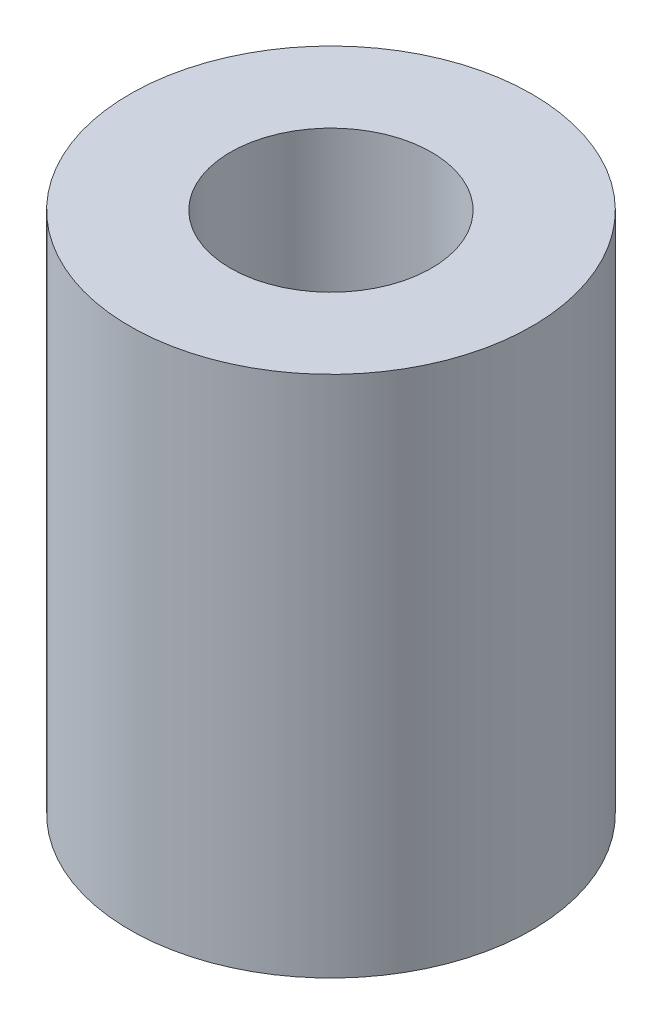
ISO-10303-21;
HEADER;
FILE_DESCRIPTION(('STEP AP214'),'2;1');
FILE_NAME('part.step','',(''),(''),'','','');
FILE_SCHEMA(('AUTOMOTIVE_DESIGN { 1 0 10303 214 1 1 1 1 }'));
ENDSEC;
DATA;
#1=APPLICATION_CONTEXT('core data for automotive mechanical design processes');
#2=APPLICATION_PROTOCOL_DEFINITION('international standard','automotive_design',2000,#1);
#3=PRODUCT_CONTEXT('',#1,'mechanical');
#4=PRODUCT('Part','Part','',(#3));
#5=PRODUCT_RELATED_PRODUCT_CATEGORY('part','',(#4));
#6=PRODUCT_DEFINITION_FORMATION('','',#4);
#7=PRODUCT_DEFINITION_CONTEXT('part definition',#1,'design');
#8=PRODUCT_DEFINITION('design','',#6,#7);
#9=PRODUCT_DEFINITION_SHAPE('','',#8);
#10=(LENGTH_UNIT() NAMED_UNIT(*) SI_UNIT(.MILLI.,.METRE.));
#11=(NAMED_UNIT(*) PLANE_ANGLE_UNIT() SI_UNIT($,.RADIAN.));
#12=(NAMED_UNIT(*) SI_UNIT($,.STERADIAN.) SOLID_ANGLE_UNIT());
#13=UNCERTAINTY_MEASURE_WITH_UNIT(LENGTH_MEASURE(1.E-05),#10,'distance_accuracy_value','');
#14=(GEOMETRIC_REPRESENTATION_CONTEXT(3) GLOBAL_UNCERTAINTY_ASSIGNED_CONTEXT((#13)) GLOBAL_UNIT_ASSIGNED_CONTEXT((#10,
#11,#12)) REPRESENTATION_CONTEXT('',''));
#15=CARTESIAN_POINT('',(0.,0.,0.));
#16=DIRECTION('',(0.,0.,1.));
#17=DIRECTION('',(1.,0.,0.));
#18=AXIS2_PLACEMENT_3D('',#15,#16,#17);
#19=CARTESIAN_POINT('',(83.5660679032848,28.7074983767564,197.378926801223));
#20=DIRECTION('',(0.,1.,0.));
#21=DIRECTION('',(0.,0.,1.));
#22=AXIS2_PLACEMENT_3D('',#19,#20,#21);
#23=CYLINDRICAL_SURFACE('',#22,1.5875);
#24=CARTESIAN_POINT('',(83.5660679032848,36.9624983767565,197.378926801223));
#25=DIRECTION('',(0.,1.,0.));
#26=DIRECTION('',(0.,0.,1.));
#27=AXIS2_PLACEMENT_3D('',#24,#25,#26);
#28=CIRCLE('',#27,1.5875);
#29=CARTESIAN_POINT('',(83.5660679032848,36.9624983767565,198.966426801223));
#30=VERTEX_POINT('',#29);
#31=EDGE_CURVE('E18',#30,#30,#28,.F.);
#32=ORIENTED_EDGE('',*,*,#31,.F.);
#33=EDGE_LOOP('',(#32));
#34=FACE_BOUND('',#33,.T.);
#35=CARTESIAN_POINT('',(83.5660679032848,28.7074983767564,197.378926801223));
#36=DIRECTION('',(0.,1.,0.));
#37=DIRECTION('',(0.,0.,1.));
#38=AXIS2_PLACEMENT_3D('',#35,#36,#37);
#39=CIRCLE('',#38,1.5875);
#40=CARTESIAN_POINT('',(83.5660679032848,28.7074983767564,198.966426801223));
#41=VERTEX_POINT('',#40);
#42=EDGE_CURVE('E30',#41,#41,#39,.F.);
#43=ORIENTED_EDGE('',*,*,#42,.T.);
#44=EDGE_LOOP('',(#43));
#45=FACE_BOUND('',#44,.T.);
#46=ADVANCED_FACE('F15',(#34,#45),#23,.F.);
#47=CARTESIAN_POINT('',(83.5660679032848,36.9624983767565,197.378926801223));
#48=DIRECTION('',(0.,1.,0.));
#49=DIRECTION('',(0.,0.,1.));
#50=AXIS2_PLACEMENT_3D('',#47,#48,#49);
#51=PLANE('',#50);
#52=ORIENTED_EDGE('',*,*,#31,.T.);
#53=EDGE_LOOP('',(#52));
#54=FACE_BOUND('',#53,.T.);
#55=CARTESIAN_POINT('',(83.5660679032848,36.9624983767565,197.378926801223));
#56=DIRECTION('',(0.,-1.,0.));
#57=DIRECTION('',(0.,0.,-1.));
#58=AXIS2_PLACEMENT_3D('',#55,#56,#57);
#59=CIRCLE('',#58,3.175);
#60=CARTESIAN_POINT('',(83.5660679032848,36.9624983767565,194.203926801223));
#61=VERTEX_POINT('',#60);
#62=EDGE_CURVE('E23',#61,#61,#59,.T.);
#63=ORIENTED_EDGE('',*,*,#62,.F.);
#64=EDGE_LOOP('',(#63));
#65=FACE_BOUND('',#64,.T.);
#66=ADVANCED_FACE('F40',(#54,#65),#51,.T.);
#67=CARTESIAN_POINT('',(83.5660679032848,28.7074983767564,197.378926801223));
#68=DIRECTION('',(0.,1.,0.));
#69=DIRECTION('',(0.,0.,1.));
#70=AXIS2_PLACEMENT_3D('',#67,#68,#69);
#71=PLANE('',#70);
#72=ORIENTED_EDGE('',*,*,#42,.F.);
#73=EDGE_LOOP('',(#72));
#74=FACE_BOUND('',#73,.T.);
#75=CARTESIAN_POINT('',(83.5660679032848,28.7074983767564,197.378926801223));
#76=DIRECTION('',(0.,-1.,0.));
#77=DIRECTION('',(0.,0.,-1.));
#78=AXIS2_PLACEMENT_3D('',#75,#76,#77);
#79=CIRCLE('',#78,3.175);
#80=CARTESIAN_POINT('',(83.5660679032848,28.7074983767564,194.203926801223));
#81=VERTEX_POINT('',#80);
#82=EDGE_CURVE('E10',#81,#81,#79,.F.);
#83=ORIENTED_EDGE('',*,*,#82,.F.);
#84=EDGE_LOOP('',(#83));
#85=FACE_BOUND('',#84,.T.);
#86=ADVANCED_FACE('F47',(#74,#85),#71,.F.);
#87=CARTESIAN_POINT('',(83.5660679032848,36.9624983767565,197.378926801223));
#88=DIRECTION('',(0.,-1.,0.));
#89=DIRECTION('',(0.,0.,-1.));
#90=AXIS2_PLACEMENT_3D('',#87,#88,#89);
#91=CYLINDRICAL_SURFACE('',#90,3.175);
#92=ORIENTED_EDGE('',*,*,#82,.T.);
#93=EDGE_LOOP('',(#92));
#94=FACE_BOUND('',#93,.T.);
#95=ORIENTED_EDGE('',*,*,#62,.T.);
#96=EDGE_LOOP('',(#95));
#97=FACE_BOUND('',#96,.T.);
#98=ADVANCED_FACE('F48',(#94,#97),#91,.T.);
#99=CLOSED_SHELL('',(#46,#66,#86,#98));
#100=MANIFOLD_SOLID_BREP('B1',#99);
#101=ADVANCED_BREP_SHAPE_REPRESENTATION('',(#18,#100),#14);
#102=SHAPE_DEFINITION_REPRESENTATION(#9,#101);
ENDSEC;
END-ISO-10303-21;
